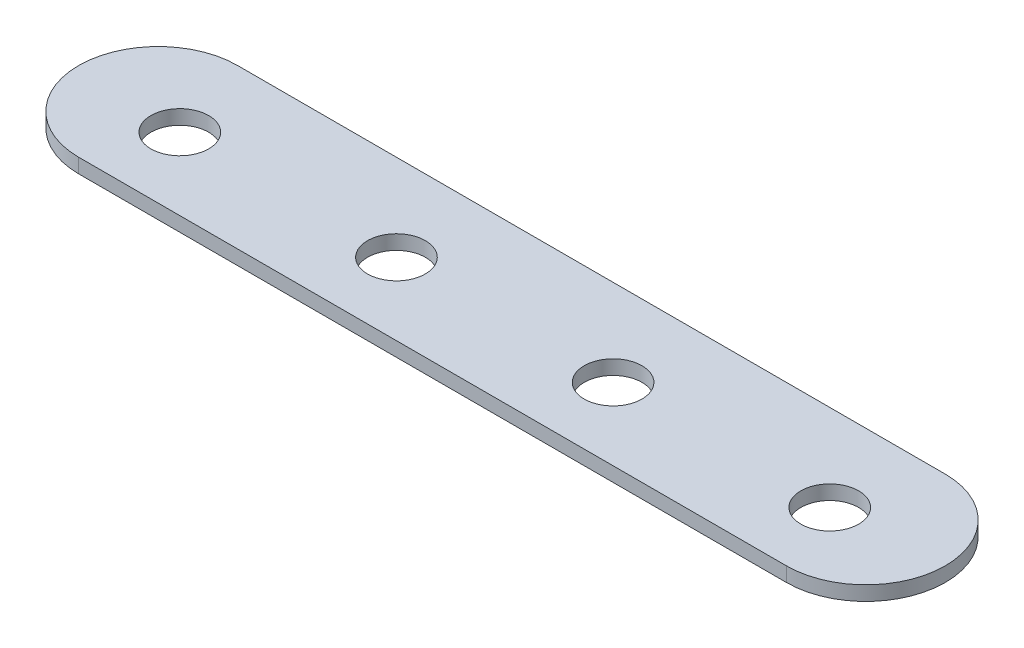
ISO-10303-21;
HEADER;
FILE_DESCRIPTION(('STEP AP214'),'2;1');
FILE_NAME('part.step','',(''),(''),'','','');
FILE_SCHEMA(('AUTOMOTIVE_DESIGN { 1 0 10303 214 1 1 1 1 }'));
ENDSEC;
DATA;
#1=APPLICATION_CONTEXT('core data for automotive mechanical design processes');
#2=APPLICATION_PROTOCOL_DEFINITION('international standard','automotive_design',2000,#1);
#3=PRODUCT_CONTEXT('',#1,'mechanical');
#4=PRODUCT('Part','Part','',(#3));
#5=PRODUCT_RELATED_PRODUCT_CATEGORY('part','',(#4));
#6=PRODUCT_DEFINITION_FORMATION('','',#4);
#7=PRODUCT_DEFINITION_CONTEXT('part definition',#1,'design');
#8=PRODUCT_DEFINITION('design','',#6,#7);
#9=PRODUCT_DEFINITION_SHAPE('','',#8);
#10=(LENGTH_UNIT() NAMED_UNIT(*) SI_UNIT(.MILLI.,.METRE.));
#11=(NAMED_UNIT(*) PLANE_ANGLE_UNIT() SI_UNIT($,.RADIAN.));
#12=(NAMED_UNIT(*) SI_UNIT($,.STERADIAN.) SOLID_ANGLE_UNIT());
#13=UNCERTAINTY_MEASURE_WITH_UNIT(LENGTH_MEASURE(1.E-05),#10,'distance_accuracy_value','');
#14=(GEOMETRIC_REPRESENTATION_CONTEXT(3) GLOBAL_UNCERTAINTY_ASSIGNED_CONTEXT((#13)) GLOBAL_UNIT_ASSIGNED_CONTEXT((#10,
#11,#12)) REPRESENTATION_CONTEXT('',''));
#15=CARTESIAN_POINT('',(0.,0.,0.));
#16=DIRECTION('',(0.,0.,1.));
#17=DIRECTION('',(1.,0.,0.));
#18=AXIS2_PLACEMENT_3D('',#15,#16,#17);
#19=CARTESIAN_POINT('',(-5.49999999999999,1.,-5.5));
#20=DIRECTION('',(0.,1.,0.));
#21=DIRECTION('',(0.,0.,1.));
#22=AXIS2_PLACEMENT_3D('',#19,#20,#21);
#23=PLANE('',#22);
#24=CARTESIAN_POINT('',(-22.5,1.,-5.));
#25=DIRECTION('',(0.,1.,0.));
#26=DIRECTION('',(0.,0.,1.));
#27=AXIS2_PLACEMENT_3D('',#24,#25,#26);
#28=CIRCLE('',#27,2.);
#29=CARTESIAN_POINT('',(-22.5,1.,-2.99999999999999));
#30=VERTEX_POINT('',#29);
#31=EDGE_CURVE('E120',#30,#30,#28,.T.);
#32=ORIENTED_EDGE('',*,*,#31,.F.);
#33=EDGE_LOOP('',(#32));
#34=FACE_BOUND('',#33,.T.);
#35=CARTESIAN_POINT('',(-52.5,1.,-5.));
#36=DIRECTION('',(0.,1.,0.));
#37=DIRECTION('',(0.,0.,1.));
#38=AXIS2_PLACEMENT_3D('',#35,#36,#37);
#39=CIRCLE('',#38,2.);
#40=CARTESIAN_POINT('',(-52.5,1.,-2.99999999999999));
#41=VERTEX_POINT('',#40);
#42=EDGE_CURVE('E99',#41,#41,#39,.T.);
#43=ORIENTED_EDGE('',*,*,#42,.F.);
#44=EDGE_LOOP('',(#43));
#45=FACE_BOUND('',#44,.T.);
#46=CARTESIAN_POINT('',(-5.49999999999999,1.,-5.5));
#47=DIRECTION('',(0.,1.,0.));
#48=DIRECTION('',(0.,0.,1.));
#49=AXIS2_PLACEMENT_3D('',#46,#47,#48);
#50=CIRCLE('',#49,5.5);
#51=CARTESIAN_POINT('',(-5.49999999999999,1.,0.));
#52=VERTEX_POINT('',#51);
#53=CARTESIAN_POINT('',(-5.49999999999999,1.,-11.));
#54=VERTEX_POINT('',#53);
#55=EDGE_CURVE('E84',#52,#54,#50,.T.);
#56=ORIENTED_EDGE('',*,*,#55,.T.);
#57=DIRECTION('',(-1.,0.,0.));
#58=VECTOR('',#57,1.);
#59=CARTESIAN_POINT('',(-5.49999999999999,1.,-11.));
#60=LINE('',#59,#58);
#61=CARTESIAN_POINT('',(-54.5,1.,-11.));
#62=VERTEX_POINT('',#61);
#63=EDGE_CURVE('E79',#54,#62,#60,.T.);
#64=ORIENTED_EDGE('',*,*,#63,.T.);
#65=CARTESIAN_POINT('',(-54.5,1.,-5.49999999999999));
#66=DIRECTION('',(0.,1.,0.));
#67=DIRECTION('',(0.,0.,1.));
#68=AXIS2_PLACEMENT_3D('',#65,#66,#67);
#69=CIRCLE('',#68,5.5);
#70=CARTESIAN_POINT('',(-54.5,1.,0.));
#71=VERTEX_POINT('',#70);
#72=EDGE_CURVE('E82',#62,#71,#69,.T.);
#73=ORIENTED_EDGE('',*,*,#72,.T.);
#74=DIRECTION('',(1.,0.,0.));
#75=VECTOR('',#74,1.);
#76=CARTESIAN_POINT('',(-5.49999999999999,1.,0.));
#77=LINE('',#76,#75);
#78=EDGE_CURVE('E49',#71,#52,#77,.T.);
#79=ORIENTED_EDGE('',*,*,#78,.T.);
#80=EDGE_LOOP('',(#56,#64,#73,#79));
#81=FACE_BOUND('',#80,.T.);
#82=CARTESIAN_POINT('',(-37.5,1.,-5.));
#83=DIRECTION('',(0.,1.,0.));
#84=DIRECTION('',(0.,0.,1.));
#85=AXIS2_PLACEMENT_3D('',#82,#83,#84);
#86=CIRCLE('',#85,2.);
#87=CARTESIAN_POINT('',(-37.5,1.,-2.99999999999999));
#88=VERTEX_POINT('',#87);
#89=EDGE_CURVE('E114',#88,#88,#86,.T.);
#90=ORIENTED_EDGE('',*,*,#89,.F.);
#91=EDGE_LOOP('',(#90));
#92=FACE_BOUND('',#91,.T.);
#93=CARTESIAN_POINT('',(-7.49999999999999,1.,-5.));
#94=DIRECTION('',(0.,1.,0.));
#95=DIRECTION('',(0.,0.,1.));
#96=AXIS2_PLACEMENT_3D('',#93,#94,#95);
#97=CIRCLE('',#96,2.);
#98=CARTESIAN_POINT('',(-7.49999999999999,1.,-2.99999999999999));
#99=VERTEX_POINT('',#98);
#100=EDGE_CURVE('E126',#99,#99,#97,.T.);
#101=ORIENTED_EDGE('',*,*,#100,.F.);
#102=EDGE_LOOP('',(#101));
#103=FACE_BOUND('',#102,.T.);
#104=ADVANCED_FACE('F32',(#34,#45,#81,#92,#103),#23,.T.);
#105=CARTESIAN_POINT('',(-5.49999999999999,0.,-5.5));
#106=DIRECTION('',(0.,1.,0.));
#107=DIRECTION('',(0.,0.,1.));
#108=AXIS2_PLACEMENT_3D('',#105,#106,#107);
#109=PLANE('',#108);
#110=CARTESIAN_POINT('',(-5.49999999999999,0.,-5.5));
#111=DIRECTION('',(0.,1.,0.));
#112=DIRECTION('',(0.,0.,1.));
#113=AXIS2_PLACEMENT_3D('',#110,#111,#112);
#114=CIRCLE('',#113,5.5);
#115=CARTESIAN_POINT('',(-5.49999999999999,0.,0.));
#116=VERTEX_POINT('',#115);
#117=CARTESIAN_POINT('',(-5.49999999999999,0.,-11.));
#118=VERTEX_POINT('',#117);
#119=EDGE_CURVE('E96',#116,#118,#114,.T.);
#120=ORIENTED_EDGE('',*,*,#119,.F.);
#121=DIRECTION('',(1.,0.,0.));
#122=VECTOR('',#121,1.);
#123=CARTESIAN_POINT('',(-5.49999999999999,0.,0.));
#124=LINE('',#123,#122);
#125=CARTESIAN_POINT('',(-54.5,0.,0.));
#126=VERTEX_POINT('',#125);
#127=EDGE_CURVE('E72',#126,#116,#124,.T.);
#128=ORIENTED_EDGE('',*,*,#127,.F.);
#129=CARTESIAN_POINT('',(-54.5,0.,-5.49999999999999));
#130=DIRECTION('',(0.,1.,0.));
#131=DIRECTION('',(0.,0.,1.));
#132=AXIS2_PLACEMENT_3D('',#129,#130,#131);
#133=CIRCLE('',#132,5.5);
#134=CARTESIAN_POINT('',(-54.5,0.,-11.));
#135=VERTEX_POINT('',#134);
#136=EDGE_CURVE('E66',#135,#126,#133,.T.);
#137=ORIENTED_EDGE('',*,*,#136,.F.);
#138=DIRECTION('',(-1.,0.,0.));
#139=VECTOR('',#138,1.);
#140=CARTESIAN_POINT('',(-5.49999999999999,0.,-11.));
#141=LINE('',#140,#139);
#142=EDGE_CURVE('E88',#118,#135,#141,.T.);
#143=ORIENTED_EDGE('',*,*,#142,.F.);
#144=EDGE_LOOP('',(#120,#128,#137,#143));
#145=FACE_BOUND('',#144,.T.);
#146=CARTESIAN_POINT('',(-52.5,0.,-5.));
#147=DIRECTION('',(0.,1.,0.));
#148=DIRECTION('',(0.,0.,1.));
#149=AXIS2_PLACEMENT_3D('',#146,#147,#148);
#150=CIRCLE('',#149,2.);
#151=CARTESIAN_POINT('',(-52.5,0.,-2.99999999999999));
#152=VERTEX_POINT('',#151);
#153=EDGE_CURVE('E111',#152,#152,#150,.T.);
#154=ORIENTED_EDGE('',*,*,#153,.T.);
#155=EDGE_LOOP('',(#154));
#156=FACE_BOUND('',#155,.T.);
#157=CARTESIAN_POINT('',(-37.5,0.,-5.));
#158=DIRECTION('',(0.,1.,0.));
#159=DIRECTION('',(0.,0.,1.));
#160=AXIS2_PLACEMENT_3D('',#157,#158,#159);
#161=CIRCLE('',#160,2.);
#162=CARTESIAN_POINT('',(-37.5,0.,-2.99999999999999));
#163=VERTEX_POINT('',#162);
#164=EDGE_CURVE('E117',#163,#163,#161,.T.);
#165=ORIENTED_EDGE('',*,*,#164,.T.);
#166=EDGE_LOOP('',(#165));
#167=FACE_BOUND('',#166,.T.);
#168=CARTESIAN_POINT('',(-22.5,0.,-5.));
#169=DIRECTION('',(0.,1.,0.));
#170=DIRECTION('',(0.,0.,1.));
#171=AXIS2_PLACEMENT_3D('',#168,#169,#170);
#172=CIRCLE('',#171,2.);
#173=CARTESIAN_POINT('',(-22.5,0.,-2.99999999999999));
#174=VERTEX_POINT('',#173);
#175=EDGE_CURVE('E123',#174,#174,#172,.T.);
#176=ORIENTED_EDGE('',*,*,#175,.T.);
#177=EDGE_LOOP('',(#176));
#178=FACE_BOUND('',#177,.T.);
#179=CARTESIAN_POINT('',(-7.49999999999999,0.,-5.));
#180=DIRECTION('',(0.,1.,0.));
#181=DIRECTION('',(0.,0.,1.));
#182=AXIS2_PLACEMENT_3D('',#179,#180,#181);
#183=CIRCLE('',#182,2.);
#184=CARTESIAN_POINT('',(-7.49999999999999,0.,-2.99999999999999));
#185=VERTEX_POINT('',#184);
#186=EDGE_CURVE('E129',#185,#185,#183,.T.);
#187=ORIENTED_EDGE('',*,*,#186,.T.);
#188=EDGE_LOOP('',(#187));
#189=FACE_BOUND('',#188,.T.);
#190=ADVANCED_FACE('F107',(#145,#156,#167,#178,#189),#109,.F.);
#191=CARTESIAN_POINT('',(-5.49999999999999,1.,-5.5));
#192=DIRECTION('',(0.,-1.,0.));
#193=DIRECTION('',(0.,0.,-1.));
#194=AXIS2_PLACEMENT_3D('',#191,#192,#193);
#195=CYLINDRICAL_SURFACE('',#194,5.5);
#196=ORIENTED_EDGE('',*,*,#119,.T.);
#197=DIRECTION('',(0.,-1.,0.));
#198=VECTOR('',#197,1.);
#199=CARTESIAN_POINT('',(-5.49999999999999,1.,-11.));
#200=LINE('',#199,#198);
#201=EDGE_CURVE('E11',#54,#118,#200,.T.);
#202=ORIENTED_EDGE('',*,*,#201,.F.);
#203=ORIENTED_EDGE('',*,*,#55,.F.);
#204=DIRECTION('',(0.,-1.,0.));
#205=VECTOR('',#204,1.);
#206=CARTESIAN_POINT('',(-5.49999999999999,1.,0.));
#207=LINE('',#206,#205);
#208=EDGE_CURVE('E92',#52,#116,#207,.T.);
#209=ORIENTED_EDGE('',*,*,#208,.T.);
#210=EDGE_LOOP('',(#196,#202,#203,#209));
#211=FACE_BOUND('',#210,.T.);
#212=ADVANCED_FACE('F34',(#211),#195,.T.);
#213=CARTESIAN_POINT('',(-5.49999999999999,1.,-11.));
#214=DIRECTION('',(0.,0.,1.));
#215=DIRECTION('',(1.,0.,0.));
#216=AXIS2_PLACEMENT_3D('',#213,#214,#215);
#217=PLANE('',#216);
#218=ORIENTED_EDGE('',*,*,#142,.T.);
#219=DIRECTION('',(0.,-1.,0.));
#220=VECTOR('',#219,1.);
#221=CARTESIAN_POINT('',(-54.5,1.,-11.));
#222=LINE('',#221,#220);
#223=EDGE_CURVE('E41',#62,#135,#222,.T.);
#224=ORIENTED_EDGE('',*,*,#223,.F.);
#225=ORIENTED_EDGE('',*,*,#63,.F.);
#226=ORIENTED_EDGE('',*,*,#201,.T.);
#227=EDGE_LOOP('',(#218,#224,#225,#226));
#228=FACE_BOUND('',#227,.T.);
#229=ADVANCED_FACE('F87',(#228),#217,.F.);
#230=CARTESIAN_POINT('',(-54.5,1.,-5.49999999999999));
#231=DIRECTION('',(0.,-1.,0.));
#232=DIRECTION('',(0.,0.,-1.));
#233=AXIS2_PLACEMENT_3D('',#230,#231,#232);
#234=CYLINDRICAL_SURFACE('',#233,5.5);
#235=ORIENTED_EDGE('',*,*,#136,.T.);
#236=DIRECTION('',(0.,-1.,0.));
#237=VECTOR('',#236,1.);
#238=CARTESIAN_POINT('',(-54.5,1.,0.));
#239=LINE('',#238,#237);
#240=EDGE_CURVE('E89',#71,#126,#239,.T.);
#241=ORIENTED_EDGE('',*,*,#240,.F.);
#242=ORIENTED_EDGE('',*,*,#72,.F.);
#243=ORIENTED_EDGE('',*,*,#223,.T.);
#244=EDGE_LOOP('',(#235,#241,#242,#243));
#245=FACE_BOUND('',#244,.T.);
#246=ADVANCED_FACE('F90',(#245),#234,.T.);
#247=CARTESIAN_POINT('',(-5.49999999999999,1.,0.));
#248=DIRECTION('',(0.,0.,-1.));
#249=DIRECTION('',(-1.,0.,0.));
#250=AXIS2_PLACEMENT_3D('',#247,#248,#249);
#251=PLANE('',#250);
#252=ORIENTED_EDGE('',*,*,#127,.T.);
#253=ORIENTED_EDGE('',*,*,#208,.F.);
#254=ORIENTED_EDGE('',*,*,#78,.F.);
#255=ORIENTED_EDGE('',*,*,#240,.T.);
#256=EDGE_LOOP('',(#252,#253,#254,#255));
#257=FACE_BOUND('',#256,.T.);
#258=ADVANCED_FACE('F104',(#257),#251,.F.);
#259=CARTESIAN_POINT('',(-52.5,1.,-5.));
#260=DIRECTION('',(0.,-1.,0.));
#261=DIRECTION('',(0.,0.,-1.));
#262=AXIS2_PLACEMENT_3D('',#259,#260,#261);
#263=CYLINDRICAL_SURFACE('',#262,2.);
#264=ORIENTED_EDGE('',*,*,#42,.T.);
#265=EDGE_LOOP('',(#264));
#266=FACE_BOUND('',#265,.T.);
#267=ORIENTED_EDGE('',*,*,#153,.F.);
#268=EDGE_LOOP('',(#267));
#269=FACE_BOUND('',#268,.T.);
#270=ADVANCED_FACE('F148',(#266,#269),#263,.F.);
#271=CARTESIAN_POINT('',(-37.5,1.,-5.));
#272=DIRECTION('',(0.,-1.,0.));
#273=DIRECTION('',(0.,0.,-1.));
#274=AXIS2_PLACEMENT_3D('',#271,#272,#273);
#275=CYLINDRICAL_SURFACE('',#274,2.);
#276=ORIENTED_EDGE('',*,*,#89,.T.);
#277=EDGE_LOOP('',(#276));
#278=FACE_BOUND('',#277,.T.);
#279=ORIENTED_EDGE('',*,*,#164,.F.);
#280=EDGE_LOOP('',(#279));
#281=FACE_BOUND('',#280,.T.);
#282=ADVANCED_FACE('F194',(#278,#281),#275,.F.);
#283=CARTESIAN_POINT('',(-22.5,1.,-5.));
#284=DIRECTION('',(0.,-1.,0.));
#285=DIRECTION('',(0.,0.,-1.));
#286=AXIS2_PLACEMENT_3D('',#283,#284,#285);
#287=CYLINDRICAL_SURFACE('',#286,2.);
#288=ORIENTED_EDGE('',*,*,#31,.T.);
#289=EDGE_LOOP('',(#288));
#290=FACE_BOUND('',#289,.T.);
#291=ORIENTED_EDGE('',*,*,#175,.F.);
#292=EDGE_LOOP('',(#291));
#293=FACE_BOUND('',#292,.T.);
#294=ADVANCED_FACE('F202',(#290,#293),#287,.F.);
#295=CARTESIAN_POINT('',(-7.49999999999999,1.,-5.));
#296=DIRECTION('',(0.,-1.,0.));
#297=DIRECTION('',(0.,0.,-1.));
#298=AXIS2_PLACEMENT_3D('',#295,#296,#297);
#299=CYLINDRICAL_SURFACE('',#298,2.);
#300=ORIENTED_EDGE('',*,*,#100,.T.);
#301=EDGE_LOOP('',(#300));
#302=FACE_BOUND('',#301,.T.);
#303=ORIENTED_EDGE('',*,*,#186,.F.);
#304=EDGE_LOOP('',(#303));
#305=FACE_BOUND('',#304,.T.);
#306=ADVANCED_FACE('F135',(#302,#305),#299,.F.);
#307=CLOSED_SHELL('',(#104,#190,#212,#229,#246,#258,#270,#282,#294,#306));
#308=MANIFOLD_SOLID_BREP('B2',#307);
#309=ADVANCED_BREP_SHAPE_REPRESENTATION('',(#18,#308),#14);
#310=SHAPE_DEFINITION_REPRESENTATION(#9,#309);
ENDSEC;
END-ISO-10303-21;
